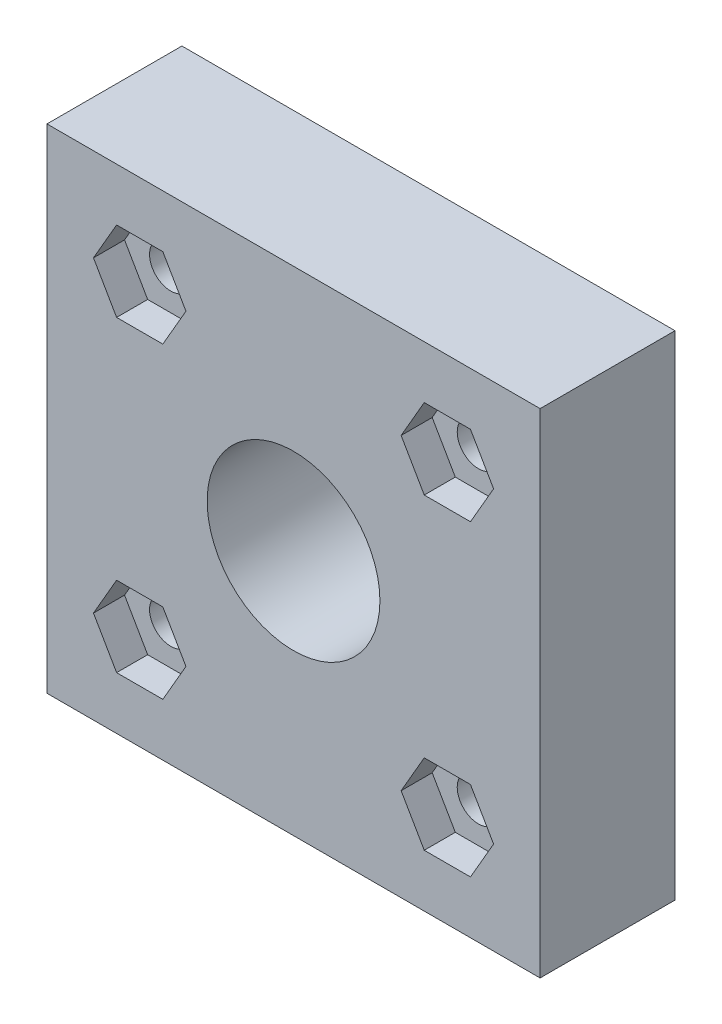
ISO-10303-21;
HEADER;
FILE_DESCRIPTION(('STEP AP214'),'2;1');
FILE_NAME('part.step','',(''),(''),'','','');
FILE_SCHEMA(('AUTOMOTIVE_DESIGN { 1 0 10303 214 1 1 1 1 }'));
ENDSEC;
DATA;
#1=APPLICATION_CONTEXT('core data for automotive mechanical design processes');
#2=APPLICATION_PROTOCOL_DEFINITION('international standard','automotive_design',2000,#1);
#3=PRODUCT_CONTEXT('',#1,'mechanical');
#4=PRODUCT('Part','Part','',(#3));
#5=PRODUCT_RELATED_PRODUCT_CATEGORY('part','',(#4));
#6=PRODUCT_DEFINITION_FORMATION('','',#4);
#7=PRODUCT_DEFINITION_CONTEXT('part definition',#1,'design');
#8=PRODUCT_DEFINITION('design','',#6,#7);
#9=PRODUCT_DEFINITION_SHAPE('','',#8);
#10=(LENGTH_UNIT() NAMED_UNIT(*) SI_UNIT(.MILLI.,.METRE.));
#11=(NAMED_UNIT(*) PLANE_ANGLE_UNIT() SI_UNIT($,.RADIAN.));
#12=(NAMED_UNIT(*) SI_UNIT($,.STERADIAN.) SOLID_ANGLE_UNIT());
#13=UNCERTAINTY_MEASURE_WITH_UNIT(LENGTH_MEASURE(1.E-05),#10,'distance_accuracy_value','');
#14=(GEOMETRIC_REPRESENTATION_CONTEXT(3) GLOBAL_UNCERTAINTY_ASSIGNED_CONTEXT((#13)) GLOBAL_UNIT_ASSIGNED_CONTEXT((#10,
#11,#12)) REPRESENTATION_CONTEXT('',''));
#15=CARTESIAN_POINT('',(0.,0.,0.));
#16=DIRECTION('',(0.,0.,1.));
#17=DIRECTION('',(1.,0.,0.));
#18=AXIS2_PLACEMENT_3D('',#15,#16,#17);
#19=CARTESIAN_POINT('',(12.7,12.7,1.6));
#20=DIRECTION('',(-1.,0.,0.));
#21=DIRECTION('',(0.,-1.,0.));
#22=AXIS2_PLACEMENT_3D('',#19,#20,#21);
#23=PLANE('',#22);
#24=DIRECTION('',(0.,0.,-1.));
#25=VECTOR('',#24,1.);
#26=CARTESIAN_POINT('',(12.7,-12.7,1.6));
#27=LINE('',#26,#25);
#28=CARTESIAN_POINT('',(12.7,-12.7,1.6));
#29=VERTEX_POINT('',#28);
#30=CARTESIAN_POINT('',(12.7,-12.7,-5.35));
#31=VERTEX_POINT('',#30);
#32=EDGE_CURVE('E216',#29,#31,#27,.T.);
#33=ORIENTED_EDGE('',*,*,#32,.T.);
#34=DIRECTION('',(0.,-1.,0.));
#35=VECTOR('',#34,1.);
#36=CARTESIAN_POINT('',(12.7,12.7,-5.35));
#37=LINE('',#36,#35);
#38=CARTESIAN_POINT('',(12.7,12.7,-5.35));
#39=VERTEX_POINT('',#38);
#40=EDGE_CURVE('E220',#39,#31,#37,.T.);
#41=ORIENTED_EDGE('',*,*,#40,.F.);
#42=DIRECTION('',(0.,0.,-1.));
#43=VECTOR('',#42,1.);
#44=CARTESIAN_POINT('',(12.7,12.7,1.6));
#45=LINE('',#44,#43);
#46=CARTESIAN_POINT('',(12.7,12.7,1.6));
#47=VERTEX_POINT('',#46);
#48=EDGE_CURVE('E11',#47,#39,#45,.T.);
#49=ORIENTED_EDGE('',*,*,#48,.F.);
#50=DIRECTION('',(0.,1.,0.));
#51=VECTOR('',#50,1.);
#52=CARTESIAN_POINT('',(12.7,12.7,1.6));
#53=LINE('',#52,#51);
#54=EDGE_CURVE('E222',#29,#47,#53,.T.);
#55=ORIENTED_EDGE('',*,*,#54,.F.);
#56=EDGE_LOOP('',(#33,#41,#49,#55));
#57=FACE_BOUND('',#56,.T.);
#58=ADVANCED_FACE('F32',(#57),#23,.F.);
#59=CARTESIAN_POINT('',(-12.7,12.7,1.6));
#60=DIRECTION('',(0.,-1.,0.));
#61=DIRECTION('',(0.,0.,-1.));
#62=AXIS2_PLACEMENT_3D('',#59,#60,#61);
#63=PLANE('',#62);
#64=ORIENTED_EDGE('',*,*,#48,.T.);
#65=DIRECTION('',(1.,0.,0.));
#66=VECTOR('',#65,1.);
#67=CARTESIAN_POINT('',(12.7,12.7,-5.35));
#68=LINE('',#67,#66);
#69=CARTESIAN_POINT('',(-12.7,12.7,-5.35));
#70=VERTEX_POINT('',#69);
#71=EDGE_CURVE('E241',#70,#39,#68,.T.);
#72=ORIENTED_EDGE('',*,*,#71,.F.);
#73=DIRECTION('',(0.,0.,-1.));
#74=VECTOR('',#73,1.);
#75=CARTESIAN_POINT('',(-12.7,12.7,1.6));
#76=LINE('',#75,#74);
#77=CARTESIAN_POINT('',(-12.7,12.7,1.6));
#78=VERTEX_POINT('',#77);
#79=EDGE_CURVE('E39',#78,#70,#76,.T.);
#80=ORIENTED_EDGE('',*,*,#79,.F.);
#81=DIRECTION('',(-1.,0.,0.));
#82=VECTOR('',#81,1.);
#83=CARTESIAN_POINT('',(-12.7,12.7,1.6));
#84=LINE('',#83,#82);
#85=EDGE_CURVE('E443',#47,#78,#84,.T.);
#86=ORIENTED_EDGE('',*,*,#85,.F.);
#87=EDGE_LOOP('',(#64,#72,#80,#86));
#88=FACE_BOUND('',#87,.T.);
#89=ADVANCED_FACE('F453',(#88),#63,.F.);
#90=CARTESIAN_POINT('',(-12.7,12.7,1.6));
#91=DIRECTION('',(1.,0.,0.));
#92=DIRECTION('',(0.,1.,0.));
#93=AXIS2_PLACEMENT_3D('',#90,#91,#92);
#94=PLANE('',#93);
#95=ORIENTED_EDGE('',*,*,#79,.T.);
#96=DIRECTION('',(0.,1.,0.));
#97=VECTOR('',#96,1.);
#98=CARTESIAN_POINT('',(-12.7,12.7,-5.35));
#99=LINE('',#98,#97);
#100=CARTESIAN_POINT('',(-12.7,-12.7,-5.35));
#101=VERTEX_POINT('',#100);
#102=EDGE_CURVE('E235',#101,#70,#99,.T.);
#103=ORIENTED_EDGE('',*,*,#102,.F.);
#104=DIRECTION('',(0.,0.,-1.));
#105=VECTOR('',#104,1.);
#106=CARTESIAN_POINT('',(-12.7,-12.7,1.6));
#107=LINE('',#106,#105);
#108=CARTESIAN_POINT('',(-12.7,-12.7,1.6));
#109=VERTEX_POINT('',#108);
#110=EDGE_CURVE('E225',#109,#101,#107,.T.);
#111=ORIENTED_EDGE('',*,*,#110,.F.);
#112=DIRECTION('',(0.,-1.,0.));
#113=VECTOR('',#112,1.);
#114=CARTESIAN_POINT('',(-12.7,12.7,1.6));
#115=LINE('',#114,#113);
#116=EDGE_CURVE('E445',#78,#109,#115,.T.);
#117=ORIENTED_EDGE('',*,*,#116,.F.);
#118=EDGE_LOOP('',(#95,#103,#111,#117));
#119=FACE_BOUND('',#118,.T.);
#120=ADVANCED_FACE('F451',(#119),#94,.F.);
#121=CARTESIAN_POINT('',(-12.7,-12.7,1.6));
#122=DIRECTION('',(0.,1.,0.));
#123=DIRECTION('',(0.,0.,1.));
#124=AXIS2_PLACEMENT_3D('',#121,#122,#123);
#125=PLANE('',#124);
#126=ORIENTED_EDGE('',*,*,#110,.T.);
#127=DIRECTION('',(-1.,0.,0.));
#128=VECTOR('',#127,1.);
#129=CARTESIAN_POINT('',(12.7,-12.7,-5.35));
#130=LINE('',#129,#128);
#131=EDGE_CURVE('E229',#31,#101,#130,.T.);
#132=ORIENTED_EDGE('',*,*,#131,.F.);
#133=ORIENTED_EDGE('',*,*,#32,.F.);
#134=DIRECTION('',(1.,0.,0.));
#135=VECTOR('',#134,1.);
#136=CARTESIAN_POINT('',(-12.7,-12.7,1.6));
#137=LINE('',#136,#135);
#138=EDGE_CURVE('E226',#109,#29,#137,.T.);
#139=ORIENTED_EDGE('',*,*,#138,.F.);
#140=EDGE_LOOP('',(#126,#132,#133,#139));
#141=FACE_BOUND('',#140,.T.);
#142=ADVANCED_FACE('F230',(#141),#125,.F.);
#143=CARTESIAN_POINT('',(0.,0.,1.6));
#144=DIRECTION('',(0.,0.,1.));
#145=DIRECTION('',(1.,0.,0.));
#146=AXIS2_PLACEMENT_3D('',#143,#144,#145);
#147=PLANE('',#146);
#148=DIRECTION('',(0.500000000000001,0.866025403784438,0.));
#149=VECTOR('',#148,1.);
#150=CARTESIAN_POINT('',(10.3045625881401,7.92331258814006,1.6));
#151=LINE('',#150,#149);
#152=CARTESIAN_POINT('',(9.11393758814007,5.86108959537837,1.6));
#153=VERTEX_POINT('',#152);
#154=CARTESIAN_POINT('',(10.3045625881401,7.92331258814006,1.6));
#155=VERTEX_POINT('',#154);
#156=EDGE_CURVE('E46',#153,#155,#151,.T.);
#157=ORIENTED_EDGE('',*,*,#156,.F.);
#158=DIRECTION('',(1.,0.,0.));
#159=VECTOR('',#158,1.);
#160=CARTESIAN_POINT('',(9.11393758814007,5.86108959537837,1.6));
#161=LINE('',#160,#159);
#162=CARTESIAN_POINT('',(6.73268758814007,5.86108959537837,1.6));
#163=VERTEX_POINT('',#162);
#164=EDGE_CURVE('E256',#163,#153,#161,.T.);
#165=ORIENTED_EDGE('',*,*,#164,.F.);
#166=DIRECTION('',(0.5,-0.866025403784439,0.));
#167=VECTOR('',#166,1.);
#168=CARTESIAN_POINT('',(6.73268758814007,5.86108959537837,1.6));
#169=LINE('',#168,#167);
#170=CARTESIAN_POINT('',(5.54206258814007,7.92331258814006,1.6));
#171=VERTEX_POINT('',#170);
#172=EDGE_CURVE('E283',#171,#163,#169,.T.);
#173=ORIENTED_EDGE('',*,*,#172,.F.);
#174=DIRECTION('',(-0.5,-0.866025403784439,0.));
#175=VECTOR('',#174,1.);
#176=CARTESIAN_POINT('',(5.54206258814007,7.92331258814006,1.6));
#177=LINE('',#176,#175);
#178=CARTESIAN_POINT('',(6.73268758814007,9.98553558090176,1.6));
#179=VERTEX_POINT('',#178);
#180=EDGE_CURVE('E280',#179,#171,#177,.T.);
#181=ORIENTED_EDGE('',*,*,#180,.F.);
#182=DIRECTION('',(-1.,0.,0.));
#183=VECTOR('',#182,1.);
#184=CARTESIAN_POINT('',(6.73268758814007,9.98553558090176,1.6));
#185=LINE('',#184,#183);
#186=CARTESIAN_POINT('',(9.11393758814007,9.98553558090176,1.6));
#187=VERTEX_POINT('',#186);
#188=EDGE_CURVE('E277',#187,#179,#185,.T.);
#189=ORIENTED_EDGE('',*,*,#188,.F.);
#190=DIRECTION('',(-0.5,0.866025403784438,0.));
#191=VECTOR('',#190,1.);
#192=CARTESIAN_POINT('',(9.11393758814007,9.98553558090176,1.6));
#193=LINE('',#192,#191);
#194=EDGE_CURVE('E273',#155,#187,#193,.T.);
#195=ORIENTED_EDGE('',*,*,#194,.F.);
#196=EDGE_LOOP('',(#157,#165,#173,#181,#189,#195));
#197=FACE_BOUND('',#196,.T.);
#198=DIRECTION('',(-1.,0.,0.));
#199=VECTOR('',#198,1.);
#200=CARTESIAN_POINT('',(9.11393758814007,-5.86108959537837,1.6));
#201=LINE('',#200,#199);
#202=CARTESIAN_POINT('',(9.11393758814007,-5.86108959537837,1.6));
#203=VERTEX_POINT('',#202);
#204=CARTESIAN_POINT('',(6.73268758814007,-5.86108959537837,1.6));
#205=VERTEX_POINT('',#204);
#206=EDGE_CURVE('E54',#203,#205,#201,.T.);
#207=ORIENTED_EDGE('',*,*,#206,.F.);
#208=DIRECTION('',(-0.500000000000001,0.866025403784438,0.));
#209=VECTOR('',#208,1.);
#210=CARTESIAN_POINT('',(10.3045625881401,-7.92331258814006,1.6));
#211=LINE('',#210,#209);
#212=CARTESIAN_POINT('',(10.3045625881401,-7.92331258814006,1.6));
#213=VERTEX_POINT('',#212);
#214=EDGE_CURVE('E304',#213,#203,#211,.T.);
#215=ORIENTED_EDGE('',*,*,#214,.F.);
#216=DIRECTION('',(0.5,0.866025403784438,0.));
#217=VECTOR('',#216,1.);
#218=CARTESIAN_POINT('',(9.11393758814007,-9.98553558090176,1.6));
#219=LINE('',#218,#217);
#220=CARTESIAN_POINT('',(9.11393758814007,-9.98553558090176,1.6));
#221=VERTEX_POINT('',#220);
#222=EDGE_CURVE('E331',#221,#213,#219,.T.);
#223=ORIENTED_EDGE('',*,*,#222,.F.);
#224=DIRECTION('',(1.,0.,0.));
#225=VECTOR('',#224,1.);
#226=CARTESIAN_POINT('',(6.73268758814007,-9.98553558090176,1.6));
#227=LINE('',#226,#225);
#228=CARTESIAN_POINT('',(6.73268758814007,-9.98553558090176,1.6));
#229=VERTEX_POINT('',#228);
#230=EDGE_CURVE('E328',#229,#221,#227,.T.);
#231=ORIENTED_EDGE('',*,*,#230,.F.);
#232=DIRECTION('',(0.5,-0.866025403784439,0.));
#233=VECTOR('',#232,1.);
#234=CARTESIAN_POINT('',(5.54206258814007,-7.92331258814006,1.6));
#235=LINE('',#234,#233);
#236=CARTESIAN_POINT('',(5.54206258814007,-7.92331258814006,1.6));
#237=VERTEX_POINT('',#236);
#238=EDGE_CURVE('E325',#237,#229,#235,.T.);
#239=ORIENTED_EDGE('',*,*,#238,.F.);
#240=DIRECTION('',(-0.5,-0.866025403784439,0.));
#241=VECTOR('',#240,1.);
#242=CARTESIAN_POINT('',(6.73268758814007,-5.86108959537837,1.6));
#243=LINE('',#242,#241);
#244=EDGE_CURVE('E321',#205,#237,#243,.T.);
#245=ORIENTED_EDGE('',*,*,#244,.F.);
#246=EDGE_LOOP('',(#207,#215,#223,#231,#239,#245));
#247=FACE_BOUND('',#246,.T.);
#248=DIRECTION('',(-0.5,-0.866025403784439,0.));
#249=VECTOR('',#248,1.);
#250=CARTESIAN_POINT('',(-10.3045625881401,-7.92331258814007,1.6));
#251=LINE('',#250,#249);
#252=CARTESIAN_POINT('',(-9.11393758814007,-5.86108959537837,1.6));
#253=VERTEX_POINT('',#252);
#254=CARTESIAN_POINT('',(-10.3045625881401,-7.92331258814007,1.6));
#255=VERTEX_POINT('',#254);
#256=EDGE_CURVE('E251',#253,#255,#251,.T.);
#257=ORIENTED_EDGE('',*,*,#256,.F.);
#258=DIRECTION('',(-1.,0.,0.));
#259=VECTOR('',#258,1.);
#260=CARTESIAN_POINT('',(-9.11393758814007,-5.86108959537837,1.6));
#261=LINE('',#260,#259);
#262=CARTESIAN_POINT('',(-6.73268758814007,-5.86108959537838,1.6));
#263=VERTEX_POINT('',#262);
#264=EDGE_CURVE('E350',#263,#253,#261,.T.);
#265=ORIENTED_EDGE('',*,*,#264,.F.);
#266=DIRECTION('',(-0.5,0.866025403784439,0.));
#267=VECTOR('',#266,1.);
#268=CARTESIAN_POINT('',(-6.73268758814007,-5.86108959537838,1.6));
#269=LINE('',#268,#267);
#270=CARTESIAN_POINT('',(-5.54206258814007,-7.92331258814007,1.6));
#271=VERTEX_POINT('',#270);
#272=EDGE_CURVE('E376',#271,#263,#269,.T.);
#273=ORIENTED_EDGE('',*,*,#272,.F.);
#274=DIRECTION('',(0.5,0.866025403784439,0.));
#275=VECTOR('',#274,1.);
#276=CARTESIAN_POINT('',(-5.54206258814007,-7.92331258814007,1.6));
#277=LINE('',#276,#275);
#278=CARTESIAN_POINT('',(-6.73268758814007,-9.98553558090176,1.6));
#279=VERTEX_POINT('',#278);
#280=EDGE_CURVE('E373',#279,#271,#277,.T.);
#281=ORIENTED_EDGE('',*,*,#280,.F.);
#282=DIRECTION('',(1.,0.,0.));
#283=VECTOR('',#282,1.);
#284=CARTESIAN_POINT('',(-6.73268758814007,-9.98553558090176,1.6));
#285=LINE('',#284,#283);
#286=CARTESIAN_POINT('',(-9.11393758814007,-9.98553558090176,1.6));
#287=VERTEX_POINT('',#286);
#288=EDGE_CURVE('E370',#287,#279,#285,.T.);
#289=ORIENTED_EDGE('',*,*,#288,.F.);
#290=DIRECTION('',(0.5,-0.866025403784438,0.));
#291=VECTOR('',#290,1.);
#292=CARTESIAN_POINT('',(-9.11393758814007,-9.98553558090176,1.6));
#293=LINE('',#292,#291);
#294=EDGE_CURVE('E367',#255,#287,#293,.T.);
#295=ORIENTED_EDGE('',*,*,#294,.F.);
#296=EDGE_LOOP('',(#257,#265,#273,#281,#289,#295));
#297=FACE_BOUND('',#296,.T.);
#298=DIRECTION('',(1.,0.,0.));
#299=VECTOR('',#298,1.);
#300=CARTESIAN_POINT('',(-9.11393758814007,5.86108959537837,1.6));
#301=LINE('',#300,#299);
#302=CARTESIAN_POINT('',(-9.11393758814007,5.86108959537837,1.6));
#303=VERTEX_POINT('',#302);
#304=CARTESIAN_POINT('',(-6.73268758814007,5.86108959537838,1.6));
#305=VERTEX_POINT('',#304);
#306=EDGE_CURVE('E290',#303,#305,#301,.T.);
#307=ORIENTED_EDGE('',*,*,#306,.F.);
#308=DIRECTION('',(0.5,-0.866025403784439,0.));
#309=VECTOR('',#308,1.);
#310=CARTESIAN_POINT('',(-10.3045625881401,7.92331258814007,1.6));
#311=LINE('',#310,#309);
#312=CARTESIAN_POINT('',(-10.3045625881401,7.92331258814007,1.6));
#313=VERTEX_POINT('',#312);
#314=EDGE_CURVE('E396',#313,#303,#311,.T.);
#315=ORIENTED_EDGE('',*,*,#314,.F.);
#316=DIRECTION('',(-0.5,-0.866025403784438,0.));
#317=VECTOR('',#316,1.);
#318=CARTESIAN_POINT('',(-9.11393758814007,9.98553558090176,1.6));
#319=LINE('',#318,#317);
#320=CARTESIAN_POINT('',(-9.11393758814007,9.98553558090176,1.6));
#321=VERTEX_POINT('',#320);
#322=EDGE_CURVE('E422',#321,#313,#319,.T.);
#323=ORIENTED_EDGE('',*,*,#322,.F.);
#324=DIRECTION('',(-1.,0.,0.));
#325=VECTOR('',#324,1.);
#326=CARTESIAN_POINT('',(-6.73268758814007,9.98553558090176,1.6));
#327=LINE('',#326,#325);
#328=CARTESIAN_POINT('',(-6.73268758814007,9.98553558090176,1.6));
#329=VERTEX_POINT('',#328);
#330=EDGE_CURVE('E419',#329,#321,#327,.T.);
#331=ORIENTED_EDGE('',*,*,#330,.F.);
#332=DIRECTION('',(-0.5,0.866025403784439,0.));
#333=VECTOR('',#332,1.);
#334=CARTESIAN_POINT('',(-5.54206258814007,7.92331258814007,1.6));
#335=LINE('',#334,#333);
#336=CARTESIAN_POINT('',(-5.54206258814007,7.92331258814007,1.6));
#337=VERTEX_POINT('',#336);
#338=EDGE_CURVE('E416',#337,#329,#335,.T.);
#339=ORIENTED_EDGE('',*,*,#338,.F.);
#340=DIRECTION('',(0.5,0.866025403784439,0.));
#341=VECTOR('',#340,1.);
#342=CARTESIAN_POINT('',(-6.73268758814007,5.86108959537838,1.6));
#343=LINE('',#342,#341);
#344=EDGE_CURVE('E413',#305,#337,#343,.T.);
#345=ORIENTED_EDGE('',*,*,#344,.F.);
#346=EDGE_LOOP('',(#307,#315,#323,#331,#339,#345));
#347=FACE_BOUND('',#346,.T.);
#348=CARTESIAN_POINT('',(0.,0.,1.6));
#349=DIRECTION('',(0.,0.,1.));
#350=DIRECTION('',(1.,0.,0.));
#351=AXIS2_PLACEMENT_3D('',#348,#349,#350);
#352=CIRCLE('',#351,4.45);
#353=CARTESIAN_POINT('',(4.45,0.,1.6));
#354=VERTEX_POINT('',#353);
#355=EDGE_CURVE('E429',#354,#354,#352,.T.);
#356=ORIENTED_EDGE('',*,*,#355,.F.);
#357=EDGE_LOOP('',(#356));
#358=FACE_BOUND('',#357,.T.);
#359=ORIENTED_EDGE('',*,*,#54,.T.);
#360=ORIENTED_EDGE('',*,*,#85,.T.);
#361=ORIENTED_EDGE('',*,*,#116,.T.);
#362=ORIENTED_EDGE('',*,*,#138,.T.);
#363=EDGE_LOOP('',(#359,#360,#361,#362));
#364=FACE_BOUND('',#363,.T.);
#365=ADVANCED_FACE('F455',(#197,#247,#297,#347,#358,#364),#147,.T.);
#366=CARTESIAN_POINT('',(0.,0.,0.));
#367=DIRECTION('',(0.,0.,1.));
#368=DIRECTION('',(1.,0.,0.));
#369=AXIS2_PLACEMENT_3D('',#366,#367,#368);
#370=CYLINDRICAL_SURFACE('',#369,4.45);
#371=ORIENTED_EDGE('',*,*,#355,.T.);
#372=EDGE_LOOP('',(#371));
#373=FACE_BOUND('',#372,.T.);
#374=CARTESIAN_POINT('',(0.,0.,-5.35));
#375=DIRECTION('',(0.,0.,-1.));
#376=DIRECTION('',(-1.,0.,0.));
#377=AXIS2_PLACEMENT_3D('',#374,#375,#376);
#378=CIRCLE('',#377,4.45);
#379=CARTESIAN_POINT('',(-4.45,0.,-5.35));
#380=VERTEX_POINT('',#379);
#381=EDGE_CURVE('E826',#380,#380,#378,.T.);
#382=ORIENTED_EDGE('',*,*,#381,.T.);
#383=EDGE_LOOP('',(#382));
#384=FACE_BOUND('',#383,.T.);
#385=ADVANCED_FACE('F457',(#373,#384),#370,.F.);
#386=CARTESIAN_POINT('',(-9.11393758814007,5.86108959537837,0.));
#387=DIRECTION('',(0.,-1.,0.));
#388=DIRECTION('',(1.,0.,0.));
#389=AXIS2_PLACEMENT_3D('',#386,#387,#388);
#390=PLANE('',#389);
#391=ORIENTED_EDGE('',*,*,#306,.T.);
#392=DIRECTION('',(0.,0.,1.));
#393=VECTOR('',#392,1.);
#394=CARTESIAN_POINT('',(-6.73268758814007,5.86108959537838,0.));
#395=LINE('',#394,#393);
#396=CARTESIAN_POINT('',(-6.73268758814007,5.86108959537838,0.));
#397=VERTEX_POINT('',#396);
#398=EDGE_CURVE('E411',#397,#305,#395,.T.);
#399=ORIENTED_EDGE('',*,*,#398,.F.);
#400=DIRECTION('',(1.,0.,0.));
#401=VECTOR('',#400,1.);
#402=CARTESIAN_POINT('',(-9.11393758814007,5.86108959537837,0.));
#403=LINE('',#402,#401);
#404=CARTESIAN_POINT('',(-9.11393758814007,5.86108959537837,0.));
#405=VERTEX_POINT('',#404);
#406=EDGE_CURVE('E392',#405,#397,#403,.T.);
#407=ORIENTED_EDGE('',*,*,#406,.F.);
#408=DIRECTION('',(0.,0.,1.));
#409=VECTOR('',#408,1.);
#410=CARTESIAN_POINT('',(-9.11393758814007,5.86108959537837,0.));
#411=LINE('',#410,#409);
#412=EDGE_CURVE('E427',#405,#303,#411,.T.);
#413=ORIENTED_EDGE('',*,*,#412,.T.);
#414=EDGE_LOOP('',(#391,#399,#407,#413));
#415=FACE_BOUND('',#414,.T.);
#416=ADVANCED_FACE('F464',(#415),#390,.F.);
#417=CARTESIAN_POINT('',(-10.3045625881401,7.92331258814007,0.));
#418=DIRECTION('',(-0.866025403784439,-0.5,0.));
#419=DIRECTION('',(0.5,-0.866025403784439,0.));
#420=AXIS2_PLACEMENT_3D('',#417,#418,#419);
#421=PLANE('',#420);
#422=ORIENTED_EDGE('',*,*,#314,.T.);
#423=ORIENTED_EDGE('',*,*,#412,.F.);
#424=DIRECTION('',(0.5,-0.866025403784439,0.));
#425=VECTOR('',#424,1.);
#426=CARTESIAN_POINT('',(-10.3045625881401,7.92331258814007,0.));
#427=LINE('',#426,#425);
#428=CARTESIAN_POINT('',(-10.3045625881401,7.92331258814007,0.));
#429=VERTEX_POINT('',#428);
#430=EDGE_CURVE('E408',#429,#405,#427,.T.);
#431=ORIENTED_EDGE('',*,*,#430,.F.);
#432=DIRECTION('',(0.,0.,1.));
#433=VECTOR('',#432,1.);
#434=CARTESIAN_POINT('',(-10.3045625881401,7.92331258814007,0.));
#435=LINE('',#434,#433);
#436=EDGE_CURVE('E430',#429,#313,#435,.T.);
#437=ORIENTED_EDGE('',*,*,#436,.T.);
#438=EDGE_LOOP('',(#422,#423,#431,#437));
#439=FACE_BOUND('',#438,.T.);
#440=ADVANCED_FACE('F501',(#439),#421,.F.);
#441=CARTESIAN_POINT('',(-9.11393758814007,9.98553558090176,0.));
#442=DIRECTION('',(-0.866025403784438,0.5,0.));
#443=DIRECTION('',(-0.5,-0.866025403784439,0.));
#444=AXIS2_PLACEMENT_3D('',#441,#442,#443);
#445=PLANE('',#444);
#446=ORIENTED_EDGE('',*,*,#322,.T.);
#447=ORIENTED_EDGE('',*,*,#436,.F.);
#448=DIRECTION('',(-0.5,-0.866025403784438,0.));
#449=VECTOR('',#448,1.);
#450=CARTESIAN_POINT('',(-9.11393758814007,9.98553558090176,0.));
#451=LINE('',#450,#449);
#452=CARTESIAN_POINT('',(-9.11393758814007,9.98553558090176,0.));
#453=VERTEX_POINT('',#452);
#454=EDGE_CURVE('E405',#453,#429,#451,.T.);
#455=ORIENTED_EDGE('',*,*,#454,.F.);
#456=DIRECTION('',(0.,0.,1.));
#457=VECTOR('',#456,1.);
#458=CARTESIAN_POINT('',(-9.11393758814007,9.98553558090176,0.));
#459=LINE('',#458,#457);
#460=EDGE_CURVE('E432',#453,#321,#459,.T.);
#461=ORIENTED_EDGE('',*,*,#460,.T.);
#462=EDGE_LOOP('',(#446,#447,#455,#461));
#463=FACE_BOUND('',#462,.T.);
#464=ADVANCED_FACE('F511',(#463),#445,.F.);
#465=CARTESIAN_POINT('',(-6.73268758814007,9.98553558090176,0.));
#466=DIRECTION('',(0.,1.,0.));
#467=DIRECTION('',(0.,0.,1.));
#468=AXIS2_PLACEMENT_3D('',#465,#466,#467);
#469=PLANE('',#468);
#470=ORIENTED_EDGE('',*,*,#330,.T.);
#471=ORIENTED_EDGE('',*,*,#460,.F.);
#472=DIRECTION('',(-1.,0.,0.));
#473=VECTOR('',#472,1.);
#474=CARTESIAN_POINT('',(-6.73268758814007,9.98553558090176,0.));
#475=LINE('',#474,#473);
#476=CARTESIAN_POINT('',(-6.73268758814007,9.98553558090176,0.));
#477=VERTEX_POINT('',#476);
#478=EDGE_CURVE('E402',#477,#453,#475,.T.);
#479=ORIENTED_EDGE('',*,*,#478,.F.);
#480=DIRECTION('',(0.,0.,1.));
#481=VECTOR('',#480,1.);
#482=CARTESIAN_POINT('',(-6.73268758814007,9.98553558090176,0.));
#483=LINE('',#482,#481);
#484=EDGE_CURVE('E434',#477,#329,#483,.T.);
#485=ORIENTED_EDGE('',*,*,#484,.T.);
#486=EDGE_LOOP('',(#470,#471,#479,#485));
#487=FACE_BOUND('',#486,.T.);
#488=ADVANCED_FACE('F521',(#487),#469,.F.);
#489=CARTESIAN_POINT('',(-5.54206258814007,7.92331258814007,0.));
#490=DIRECTION('',(0.866025403784439,0.5,0.));
#491=DIRECTION('',(-0.5,0.866025403784439,0.));
#492=AXIS2_PLACEMENT_3D('',#489,#490,#491);
#493=PLANE('',#492);
#494=ORIENTED_EDGE('',*,*,#338,.T.);
#495=ORIENTED_EDGE('',*,*,#484,.F.);
#496=DIRECTION('',(-0.5,0.866025403784439,0.));
#497=VECTOR('',#496,1.);
#498=CARTESIAN_POINT('',(-5.54206258814007,7.92331258814007,0.));
#499=LINE('',#498,#497);
#500=CARTESIAN_POINT('',(-5.54206258814007,7.92331258814007,0.));
#501=VERTEX_POINT('',#500);
#502=EDGE_CURVE('E399',#501,#477,#499,.T.);
#503=ORIENTED_EDGE('',*,*,#502,.F.);
#504=DIRECTION('',(0.,0.,1.));
#505=VECTOR('',#504,1.);
#506=CARTESIAN_POINT('',(-5.54206258814007,7.92331258814007,0.));
#507=LINE('',#506,#505);
#508=EDGE_CURVE('E436',#501,#337,#507,.T.);
#509=ORIENTED_EDGE('',*,*,#508,.T.);
#510=EDGE_LOOP('',(#494,#495,#503,#509));
#511=FACE_BOUND('',#510,.T.);
#512=ADVANCED_FACE('F531',(#511),#493,.F.);
#513=CARTESIAN_POINT('',(-6.73268758814007,5.86108959537838,0.));
#514=DIRECTION('',(0.866025403784439,-0.5,0.));
#515=DIRECTION('',(0.5,0.866025403784439,0.));
#516=AXIS2_PLACEMENT_3D('',#513,#514,#515);
#517=PLANE('',#516);
#518=ORIENTED_EDGE('',*,*,#344,.T.);
#519=ORIENTED_EDGE('',*,*,#508,.F.);
#520=DIRECTION('',(0.5,0.866025403784439,0.));
#521=VECTOR('',#520,1.);
#522=CARTESIAN_POINT('',(-6.73268758814007,5.86108959537838,0.));
#523=LINE('',#522,#521);
#524=EDGE_CURVE('E395',#397,#501,#523,.T.);
#525=ORIENTED_EDGE('',*,*,#524,.F.);
#526=ORIENTED_EDGE('',*,*,#398,.T.);
#527=EDGE_LOOP('',(#518,#519,#525,#526));
#528=FACE_BOUND('',#527,.T.);
#529=ADVANCED_FACE('F541',(#528),#517,.F.);
#530=CARTESIAN_POINT('',(-10.3045625881401,-7.92331258814007,0.));
#531=DIRECTION('',(-0.866025403784439,0.5,0.));
#532=DIRECTION('',(-0.5,-0.866025403784439,0.));
#533=AXIS2_PLACEMENT_3D('',#530,#531,#532);
#534=PLANE('',#533);
#535=ORIENTED_EDGE('',*,*,#256,.T.);
#536=DIRECTION('',(0.,0.,1.));
#537=VECTOR('',#536,1.);
#538=CARTESIAN_POINT('',(-10.3045625881401,-7.92331258814007,0.));
#539=LINE('',#538,#537);
#540=CARTESIAN_POINT('',(-10.3045625881401,-7.92331258814007,0.));
#541=VERTEX_POINT('',#540);
#542=EDGE_CURVE('E365',#541,#255,#539,.T.);
#543=ORIENTED_EDGE('',*,*,#542,.F.);
#544=DIRECTION('',(-0.5,-0.866025403784439,0.));
#545=VECTOR('',#544,1.);
#546=CARTESIAN_POINT('',(-10.3045625881401,-7.92331258814007,0.));
#547=LINE('',#546,#545);
#548=CARTESIAN_POINT('',(-9.11393758814007,-5.86108959537837,0.));
#549=VERTEX_POINT('',#548);
#550=EDGE_CURVE('E346',#549,#541,#547,.T.);
#551=ORIENTED_EDGE('',*,*,#550,.F.);
#552=DIRECTION('',(0.,0.,1.));
#553=VECTOR('',#552,1.);
#554=CARTESIAN_POINT('',(-9.11393758814007,-5.86108959537837,0.));
#555=LINE('',#554,#553);
#556=EDGE_CURVE('E322',#549,#253,#555,.T.);
#557=ORIENTED_EDGE('',*,*,#556,.T.);
#558=EDGE_LOOP('',(#535,#543,#551,#557));
#559=FACE_BOUND('',#558,.T.);
#560=ADVANCED_FACE('F551',(#559),#534,.F.);
#561=CARTESIAN_POINT('',(-9.11393758814007,-5.86108959537837,0.));
#562=DIRECTION('',(0.,1.,0.));
#563=DIRECTION('',(-1.,0.,0.));
#564=AXIS2_PLACEMENT_3D('',#561,#562,#563);
#565=PLANE('',#564);
#566=ORIENTED_EDGE('',*,*,#264,.T.);
#567=ORIENTED_EDGE('',*,*,#556,.F.);
#568=DIRECTION('',(-1.,0.,0.));
#569=VECTOR('',#568,1.);
#570=CARTESIAN_POINT('',(-9.11393758814007,-5.86108959537837,0.));
#571=LINE('',#570,#569);
#572=CARTESIAN_POINT('',(-6.73268758814007,-5.86108959537838,0.));
#573=VERTEX_POINT('',#572);
#574=EDGE_CURVE('E362',#573,#549,#571,.T.);
#575=ORIENTED_EDGE('',*,*,#574,.F.);
#576=DIRECTION('',(0.,0.,1.));
#577=VECTOR('',#576,1.);
#578=CARTESIAN_POINT('',(-6.73268758814007,-5.86108959537838,0.));
#579=LINE('',#578,#577);
#580=EDGE_CURVE('E382',#573,#263,#579,.T.);
#581=ORIENTED_EDGE('',*,*,#580,.T.);
#582=EDGE_LOOP('',(#566,#567,#575,#581));
#583=FACE_BOUND('',#582,.T.);
#584=ADVANCED_FACE('F561',(#583),#565,.F.);
#585=CARTESIAN_POINT('',(-6.73268758814007,-5.86108959537838,0.));
#586=DIRECTION('',(0.866025403784439,0.5,0.));
#587=DIRECTION('',(-0.5,0.866025403784439,0.));
#588=AXIS2_PLACEMENT_3D('',#585,#586,#587);
#589=PLANE('',#588);
#590=ORIENTED_EDGE('',*,*,#272,.T.);
#591=ORIENTED_EDGE('',*,*,#580,.F.);
#592=DIRECTION('',(-0.5,0.866025403784439,0.));
#593=VECTOR('',#592,1.);
#594=CARTESIAN_POINT('',(-6.73268758814007,-5.86108959537838,0.));
#595=LINE('',#594,#593);
#596=CARTESIAN_POINT('',(-5.54206258814007,-7.92331258814007,0.));
#597=VERTEX_POINT('',#596);
#598=EDGE_CURVE('E359',#597,#573,#595,.T.);
#599=ORIENTED_EDGE('',*,*,#598,.F.);
#600=DIRECTION('',(0.,0.,1.));
#601=VECTOR('',#600,1.);
#602=CARTESIAN_POINT('',(-5.54206258814007,-7.92331258814007,0.));
#603=LINE('',#602,#601);
#604=EDGE_CURVE('E384',#597,#271,#603,.T.);
#605=ORIENTED_EDGE('',*,*,#604,.T.);
#606=EDGE_LOOP('',(#590,#591,#599,#605));
#607=FACE_BOUND('',#606,.T.);
#608=ADVANCED_FACE('F571',(#607),#589,.F.);
#609=CARTESIAN_POINT('',(-5.54206258814007,-7.92331258814007,0.));
#610=DIRECTION('',(0.866025403784439,-0.5,0.));
#611=DIRECTION('',(0.5,0.866025403784439,0.));
#612=AXIS2_PLACEMENT_3D('',#609,#610,#611);
#613=PLANE('',#612);
#614=ORIENTED_EDGE('',*,*,#280,.T.);
#615=ORIENTED_EDGE('',*,*,#604,.F.);
#616=DIRECTION('',(0.5,0.866025403784439,0.));
#617=VECTOR('',#616,1.);
#618=CARTESIAN_POINT('',(-5.54206258814007,-7.92331258814007,0.));
#619=LINE('',#618,#617);
#620=CARTESIAN_POINT('',(-6.73268758814007,-9.98553558090176,0.));
#621=VERTEX_POINT('',#620);
#622=EDGE_CURVE('E356',#621,#597,#619,.T.);
#623=ORIENTED_EDGE('',*,*,#622,.F.);
#624=DIRECTION('',(0.,0.,1.));
#625=VECTOR('',#624,1.);
#626=CARTESIAN_POINT('',(-6.73268758814007,-9.98553558090176,0.));
#627=LINE('',#626,#625);
#628=EDGE_CURVE('E386',#621,#279,#627,.T.);
#629=ORIENTED_EDGE('',*,*,#628,.T.);
#630=EDGE_LOOP('',(#614,#615,#623,#629));
#631=FACE_BOUND('',#630,.T.);
#632=ADVANCED_FACE('F581',(#631),#613,.F.);
#633=CARTESIAN_POINT('',(-6.73268758814007,-9.98553558090176,0.));
#634=DIRECTION('',(0.,-1.,0.));
#635=DIRECTION('',(0.,0.,-1.));
#636=AXIS2_PLACEMENT_3D('',#633,#634,#635);
#637=PLANE('',#636);
#638=ORIENTED_EDGE('',*,*,#288,.T.);
#639=ORIENTED_EDGE('',*,*,#628,.F.);
#640=DIRECTION('',(1.,0.,0.));
#641=VECTOR('',#640,1.);
#642=CARTESIAN_POINT('',(-6.73268758814007,-9.98553558090176,0.));
#643=LINE('',#642,#641);
#644=CARTESIAN_POINT('',(-9.11393758814007,-9.98553558090176,0.));
#645=VERTEX_POINT('',#644);
#646=EDGE_CURVE('E353',#645,#621,#643,.T.);
#647=ORIENTED_EDGE('',*,*,#646,.F.);
#648=DIRECTION('',(0.,0.,1.));
#649=VECTOR('',#648,1.);
#650=CARTESIAN_POINT('',(-9.11393758814007,-9.98553558090176,0.));
#651=LINE('',#650,#649);
#652=EDGE_CURVE('E388',#645,#287,#651,.T.);
#653=ORIENTED_EDGE('',*,*,#652,.T.);
#654=EDGE_LOOP('',(#638,#639,#647,#653));
#655=FACE_BOUND('',#654,.T.);
#656=ADVANCED_FACE('F591',(#655),#637,.F.);
#657=CARTESIAN_POINT('',(-9.11393758814007,-9.98553558090176,0.));
#658=DIRECTION('',(-0.866025403784438,-0.5,0.));
#659=DIRECTION('',(0.5,-0.866025403784439,0.));
#660=AXIS2_PLACEMENT_3D('',#657,#658,#659);
#661=PLANE('',#660);
#662=ORIENTED_EDGE('',*,*,#294,.T.);
#663=ORIENTED_EDGE('',*,*,#652,.F.);
#664=DIRECTION('',(0.5,-0.866025403784438,0.));
#665=VECTOR('',#664,1.);
#666=CARTESIAN_POINT('',(-9.11393758814007,-9.98553558090176,0.));
#667=LINE('',#666,#665);
#668=EDGE_CURVE('E349',#541,#645,#667,.T.);
#669=ORIENTED_EDGE('',*,*,#668,.F.);
#670=ORIENTED_EDGE('',*,*,#542,.T.);
#671=EDGE_LOOP('',(#662,#663,#669,#670));
#672=FACE_BOUND('',#671,.T.);
#673=ADVANCED_FACE('F601',(#672),#661,.F.);
#674=CARTESIAN_POINT('',(9.11393758814007,-5.86108959537837,0.));
#675=DIRECTION('',(0.,1.,0.));
#676=DIRECTION('',(-1.,0.,0.));
#677=AXIS2_PLACEMENT_3D('',#674,#675,#676);
#678=PLANE('',#677);
#679=ORIENTED_EDGE('',*,*,#206,.T.);
#680=DIRECTION('',(0.,0.,1.));
#681=VECTOR('',#680,1.);
#682=CARTESIAN_POINT('',(6.73268758814007,-5.86108959537837,0.));
#683=LINE('',#682,#681);
#684=CARTESIAN_POINT('',(6.73268758814007,-5.86108959537837,0.));
#685=VERTEX_POINT('',#684);
#686=EDGE_CURVE('E319',#685,#205,#683,.T.);
#687=ORIENTED_EDGE('',*,*,#686,.F.);
#688=DIRECTION('',(-1.,0.,0.));
#689=VECTOR('',#688,1.);
#690=CARTESIAN_POINT('',(9.11393758814007,-5.86108959537837,0.));
#691=LINE('',#690,#689);
#692=CARTESIAN_POINT('',(9.11393758814007,-5.86108959537837,0.));
#693=VERTEX_POINT('',#692);
#694=EDGE_CURVE('E300',#693,#685,#691,.T.);
#695=ORIENTED_EDGE('',*,*,#694,.F.);
#696=DIRECTION('',(0.,0.,1.));
#697=VECTOR('',#696,1.);
#698=CARTESIAN_POINT('',(9.11393758814007,-5.86108959537837,0.));
#699=LINE('',#698,#697);
#700=EDGE_CURVE('E274',#693,#203,#699,.T.);
#701=ORIENTED_EDGE('',*,*,#700,.T.);
#702=EDGE_LOOP('',(#679,#687,#695,#701));
#703=FACE_BOUND('',#702,.T.);
#704=ADVANCED_FACE('F611',(#703),#678,.F.);
#705=CARTESIAN_POINT('',(10.3045625881401,-7.92331258814006,0.));
#706=DIRECTION('',(0.866025403784438,0.500000000000001,0.));
#707=DIRECTION('',(-0.500000000000001,0.866025403784438,0.));
#708=AXIS2_PLACEMENT_3D('',#705,#706,#707);
#709=PLANE('',#708);
#710=ORIENTED_EDGE('',*,*,#214,.T.);
#711=ORIENTED_EDGE('',*,*,#700,.F.);
#712=DIRECTION('',(-0.500000000000001,0.866025403784438,0.));
#713=VECTOR('',#712,1.);
#714=CARTESIAN_POINT('',(10.3045625881401,-7.92331258814006,0.));
#715=LINE('',#714,#713);
#716=CARTESIAN_POINT('',(10.3045625881401,-7.92331258814006,0.));
#717=VERTEX_POINT('',#716);
#718=EDGE_CURVE('E316',#717,#693,#715,.T.);
#719=ORIENTED_EDGE('',*,*,#718,.F.);
#720=DIRECTION('',(0.,0.,1.));
#721=VECTOR('',#720,1.);
#722=CARTESIAN_POINT('',(10.3045625881401,-7.92331258814006,0.));
#723=LINE('',#722,#721);
#724=EDGE_CURVE('E337',#717,#213,#723,.T.);
#725=ORIENTED_EDGE('',*,*,#724,.T.);
#726=EDGE_LOOP('',(#710,#711,#719,#725));
#727=FACE_BOUND('',#726,.T.);
#728=ADVANCED_FACE('F621',(#727),#709,.F.);
#729=CARTESIAN_POINT('',(9.11393758814007,-9.98553558090176,0.));
#730=DIRECTION('',(0.866025403784438,-0.5,0.));
#731=DIRECTION('',(0.5,0.866025403784439,0.));
#732=AXIS2_PLACEMENT_3D('',#729,#730,#731);
#733=PLANE('',#732);
#734=ORIENTED_EDGE('',*,*,#222,.T.);
#735=ORIENTED_EDGE('',*,*,#724,.F.);
#736=DIRECTION('',(0.5,0.866025403784438,0.));
#737=VECTOR('',#736,1.);
#738=CARTESIAN_POINT('',(9.11393758814007,-9.98553558090176,0.));
#739=LINE('',#738,#737);
#740=CARTESIAN_POINT('',(9.11393758814007,-9.98553558090176,0.));
#741=VERTEX_POINT('',#740);
#742=EDGE_CURVE('E313',#741,#717,#739,.T.);
#743=ORIENTED_EDGE('',*,*,#742,.F.);
#744=DIRECTION('',(0.,0.,1.));
#745=VECTOR('',#744,1.);
#746=CARTESIAN_POINT('',(9.11393758814007,-9.98553558090176,0.));
#747=LINE('',#746,#745);
#748=EDGE_CURVE('E339',#741,#221,#747,.T.);
#749=ORIENTED_EDGE('',*,*,#748,.T.);
#750=EDGE_LOOP('',(#734,#735,#743,#749));
#751=FACE_BOUND('',#750,.T.);
#752=ADVANCED_FACE('F630',(#751),#733,.F.);
#753=CARTESIAN_POINT('',(6.73268758814007,-9.98553558090176,0.));
#754=DIRECTION('',(0.,-1.,0.));
#755=DIRECTION('',(0.,0.,-1.));
#756=AXIS2_PLACEMENT_3D('',#753,#754,#755);
#757=PLANE('',#756);
#758=ORIENTED_EDGE('',*,*,#230,.T.);
#759=ORIENTED_EDGE('',*,*,#748,.F.);
#760=DIRECTION('',(1.,0.,0.));
#761=VECTOR('',#760,1.);
#762=CARTESIAN_POINT('',(6.73268758814007,-9.98553558090176,0.));
#763=LINE('',#762,#761);
#764=CARTESIAN_POINT('',(6.73268758814007,-9.98553558090176,0.));
#765=VERTEX_POINT('',#764);
#766=EDGE_CURVE('E310',#765,#741,#763,.T.);
#767=ORIENTED_EDGE('',*,*,#766,.F.);
#768=DIRECTION('',(0.,0.,1.));
#769=VECTOR('',#768,1.);
#770=CARTESIAN_POINT('',(6.73268758814007,-9.98553558090176,0.));
#771=LINE('',#770,#769);
#772=EDGE_CURVE('E341',#765,#229,#771,.T.);
#773=ORIENTED_EDGE('',*,*,#772,.T.);
#774=EDGE_LOOP('',(#758,#759,#767,#773));
#775=FACE_BOUND('',#774,.T.);
#776=ADVANCED_FACE('F640',(#775),#757,.F.);
#777=CARTESIAN_POINT('',(5.54206258814007,-7.92331258814006,0.));
#778=DIRECTION('',(-0.866025403784439,-0.5,0.));
#779=DIRECTION('',(0.5,-0.866025403784439,0.));
#780=AXIS2_PLACEMENT_3D('',#777,#778,#779);
#781=PLANE('',#780);
#782=ORIENTED_EDGE('',*,*,#238,.T.);
#783=ORIENTED_EDGE('',*,*,#772,.F.);
#784=DIRECTION('',(0.5,-0.866025403784439,0.));
#785=VECTOR('',#784,1.);
#786=CARTESIAN_POINT('',(5.54206258814007,-7.92331258814006,0.));
#787=LINE('',#786,#785);
#788=CARTESIAN_POINT('',(5.54206258814007,-7.92331258814006,0.));
#789=VERTEX_POINT('',#788);
#790=EDGE_CURVE('E307',#789,#765,#787,.T.);
#791=ORIENTED_EDGE('',*,*,#790,.F.);
#792=DIRECTION('',(0.,0.,1.));
#793=VECTOR('',#792,1.);
#794=CARTESIAN_POINT('',(5.54206258814007,-7.92331258814006,0.));
#795=LINE('',#794,#793);
#796=EDGE_CURVE('E343',#789,#237,#795,.T.);
#797=ORIENTED_EDGE('',*,*,#796,.T.);
#798=EDGE_LOOP('',(#782,#783,#791,#797));
#799=FACE_BOUND('',#798,.T.);
#800=ADVANCED_FACE('F650',(#799),#781,.F.);
#801=CARTESIAN_POINT('',(6.73268758814007,-5.86108959537837,0.));
#802=DIRECTION('',(-0.866025403784439,0.5,0.));
#803=DIRECTION('',(-0.5,-0.866025403784439,0.));
#804=AXIS2_PLACEMENT_3D('',#801,#802,#803);
#805=PLANE('',#804);
#806=ORIENTED_EDGE('',*,*,#244,.T.);
#807=ORIENTED_EDGE('',*,*,#796,.F.);
#808=DIRECTION('',(-0.5,-0.866025403784439,0.));
#809=VECTOR('',#808,1.);
#810=CARTESIAN_POINT('',(6.73268758814007,-5.86108959537837,0.));
#811=LINE('',#810,#809);
#812=EDGE_CURVE('E303',#685,#789,#811,.T.);
#813=ORIENTED_EDGE('',*,*,#812,.F.);
#814=ORIENTED_EDGE('',*,*,#686,.T.);
#815=EDGE_LOOP('',(#806,#807,#813,#814));
#816=FACE_BOUND('',#815,.T.);
#817=ADVANCED_FACE('F660',(#816),#805,.F.);
#818=CARTESIAN_POINT('',(10.3045625881401,7.92331258814006,0.));
#819=DIRECTION('',(0.866025403784438,-0.500000000000001,0.));
#820=DIRECTION('',(0.500000000000001,0.866025403784438,0.));
#821=AXIS2_PLACEMENT_3D('',#818,#819,#820);
#822=PLANE('',#821);
#823=ORIENTED_EDGE('',*,*,#156,.T.);
#824=DIRECTION('',(0.,0.,1.));
#825=VECTOR('',#824,1.);
#826=CARTESIAN_POINT('',(10.3045625881401,7.92331258814006,0.));
#827=LINE('',#826,#825);
#828=CARTESIAN_POINT('',(10.3045625881401,7.92331258814006,0.));
#829=VERTEX_POINT('',#828);
#830=EDGE_CURVE('E271',#829,#155,#827,.T.);
#831=ORIENTED_EDGE('',*,*,#830,.F.);
#832=DIRECTION('',(0.500000000000001,0.866025403784438,0.));
#833=VECTOR('',#832,1.);
#834=CARTESIAN_POINT('',(10.3045625881401,7.92331258814006,0.));
#835=LINE('',#834,#833);
#836=CARTESIAN_POINT('',(9.11393758814007,5.86108959537837,0.));
#837=VERTEX_POINT('',#836);
#838=EDGE_CURVE('E252',#837,#829,#835,.T.);
#839=ORIENTED_EDGE('',*,*,#838,.F.);
#840=DIRECTION('',(0.,0.,1.));
#841=VECTOR('',#840,1.);
#842=CARTESIAN_POINT('',(9.11393758814007,5.86108959537837,0.));
#843=LINE('',#842,#841);
#844=EDGE_CURVE('E288',#837,#153,#843,.T.);
#845=ORIENTED_EDGE('',*,*,#844,.T.);
#846=EDGE_LOOP('',(#823,#831,#839,#845));
#847=FACE_BOUND('',#846,.T.);
#848=ADVANCED_FACE('F670',(#847),#822,.F.);
#849=CARTESIAN_POINT('',(9.11393758814007,5.86108959537837,0.));
#850=DIRECTION('',(0.,-1.,0.));
#851=DIRECTION('',(1.,0.,0.));
#852=AXIS2_PLACEMENT_3D('',#849,#850,#851);
#853=PLANE('',#852);
#854=ORIENTED_EDGE('',*,*,#164,.T.);
#855=ORIENTED_EDGE('',*,*,#844,.F.);
#856=DIRECTION('',(1.,0.,0.));
#857=VECTOR('',#856,1.);
#858=CARTESIAN_POINT('',(9.11393758814007,5.86108959537837,0.));
#859=LINE('',#858,#857);
#860=CARTESIAN_POINT('',(6.73268758814007,5.86108959537837,0.));
#861=VERTEX_POINT('',#860);
#862=EDGE_CURVE('E268',#861,#837,#859,.T.);
#863=ORIENTED_EDGE('',*,*,#862,.F.);
#864=DIRECTION('',(0.,0.,1.));
#865=VECTOR('',#864,1.);
#866=CARTESIAN_POINT('',(6.73268758814007,5.86108959537837,0.));
#867=LINE('',#866,#865);
#868=EDGE_CURVE('E291',#861,#163,#867,.T.);
#869=ORIENTED_EDGE('',*,*,#868,.T.);
#870=EDGE_LOOP('',(#854,#855,#863,#869));
#871=FACE_BOUND('',#870,.T.);
#872=ADVANCED_FACE('F680',(#871),#853,.F.);
#873=CARTESIAN_POINT('',(6.73268758814007,5.86108959537837,0.));
#874=DIRECTION('',(-0.866025403784439,-0.5,0.));
#875=DIRECTION('',(0.5,-0.866025403784439,0.));
#876=AXIS2_PLACEMENT_3D('',#873,#874,#875);
#877=PLANE('',#876);
#878=ORIENTED_EDGE('',*,*,#172,.T.);
#879=ORIENTED_EDGE('',*,*,#868,.F.);
#880=DIRECTION('',(0.5,-0.866025403784439,0.));
#881=VECTOR('',#880,1.);
#882=CARTESIAN_POINT('',(6.73268758814007,5.86108959537837,0.));
#883=LINE('',#882,#881);
#884=CARTESIAN_POINT('',(5.54206258814007,7.92331258814006,0.));
#885=VERTEX_POINT('',#884);
#886=EDGE_CURVE('E265',#885,#861,#883,.T.);
#887=ORIENTED_EDGE('',*,*,#886,.F.);
#888=DIRECTION('',(0.,0.,1.));
#889=VECTOR('',#888,1.);
#890=CARTESIAN_POINT('',(5.54206258814007,7.92331258814006,0.));
#891=LINE('',#890,#889);
#892=EDGE_CURVE('E293',#885,#171,#891,.T.);
#893=ORIENTED_EDGE('',*,*,#892,.T.);
#894=EDGE_LOOP('',(#878,#879,#887,#893));
#895=FACE_BOUND('',#894,.T.);
#896=ADVANCED_FACE('F689',(#895),#877,.F.);
#897=CARTESIAN_POINT('',(5.54206258814007,7.92331258814006,0.));
#898=DIRECTION('',(-0.866025403784439,0.5,0.));
#899=DIRECTION('',(-0.5,-0.866025403784439,0.));
#900=AXIS2_PLACEMENT_3D('',#897,#898,#899);
#901=PLANE('',#900);
#902=ORIENTED_EDGE('',*,*,#180,.T.);
#903=ORIENTED_EDGE('',*,*,#892,.F.);
#904=DIRECTION('',(-0.5,-0.866025403784439,0.));
#905=VECTOR('',#904,1.);
#906=CARTESIAN_POINT('',(5.54206258814007,7.92331258814006,0.));
#907=LINE('',#906,#905);
#908=CARTESIAN_POINT('',(6.73268758814007,9.98553558090176,0.));
#909=VERTEX_POINT('',#908);
#910=EDGE_CURVE('E262',#909,#885,#907,.T.);
#911=ORIENTED_EDGE('',*,*,#910,.F.);
#912=DIRECTION('',(0.,0.,1.));
#913=VECTOR('',#912,1.);
#914=CARTESIAN_POINT('',(6.73268758814007,9.98553558090176,0.));
#915=LINE('',#914,#913);
#916=EDGE_CURVE('E295',#909,#179,#915,.T.);
#917=ORIENTED_EDGE('',*,*,#916,.T.);
#918=EDGE_LOOP('',(#902,#903,#911,#917));
#919=FACE_BOUND('',#918,.T.);
#920=ADVANCED_FACE('F699',(#919),#901,.F.);
#921=CARTESIAN_POINT('',(6.73268758814007,9.98553558090176,0.));
#922=DIRECTION('',(0.,1.,0.));
#923=DIRECTION('',(0.,0.,1.));
#924=AXIS2_PLACEMENT_3D('',#921,#922,#923);
#925=PLANE('',#924);
#926=ORIENTED_EDGE('',*,*,#188,.T.);
#927=ORIENTED_EDGE('',*,*,#916,.F.);
#928=DIRECTION('',(-1.,0.,0.));
#929=VECTOR('',#928,1.);
#930=CARTESIAN_POINT('',(6.73268758814007,9.98553558090176,0.));
#931=LINE('',#930,#929);
#932=CARTESIAN_POINT('',(9.11393758814007,9.98553558090176,0.));
#933=VERTEX_POINT('',#932);
#934=EDGE_CURVE('E259',#933,#909,#931,.T.);
#935=ORIENTED_EDGE('',*,*,#934,.F.);
#936=DIRECTION('',(0.,0.,1.));
#937=VECTOR('',#936,1.);
#938=CARTESIAN_POINT('',(9.11393758814007,9.98553558090176,0.));
#939=LINE('',#938,#937);
#940=EDGE_CURVE('E297',#933,#187,#939,.T.);
#941=ORIENTED_EDGE('',*,*,#940,.T.);
#942=EDGE_LOOP('',(#926,#927,#935,#941));
#943=FACE_BOUND('',#942,.T.);
#944=ADVANCED_FACE('F709',(#943),#925,.F.);
#945=CARTESIAN_POINT('',(9.11393758814007,9.98553558090176,0.));
#946=DIRECTION('',(0.866025403784438,0.5,0.));
#947=DIRECTION('',(-0.5,0.866025403784439,0.));
#948=AXIS2_PLACEMENT_3D('',#945,#946,#947);
#949=PLANE('',#948);
#950=ORIENTED_EDGE('',*,*,#194,.T.);
#951=ORIENTED_EDGE('',*,*,#940,.F.);
#952=DIRECTION('',(-0.5,0.866025403784438,0.));
#953=VECTOR('',#952,1.);
#954=CARTESIAN_POINT('',(9.11393758814007,9.98553558090176,0.));
#955=LINE('',#954,#953);
#956=EDGE_CURVE('E255',#829,#933,#955,.T.);
#957=ORIENTED_EDGE('',*,*,#956,.F.);
#958=ORIENTED_EDGE('',*,*,#830,.T.);
#959=EDGE_LOOP('',(#950,#951,#957,#958));
#960=FACE_BOUND('',#959,.T.);
#961=ADVANCED_FACE('F719',(#960),#949,.F.);
#962=CARTESIAN_POINT('',(0.,0.,0.));
#963=DIRECTION('',(0.,0.,-1.));
#964=DIRECTION('',(-1.,0.,0.));
#965=AXIS2_PLACEMENT_3D('',#962,#963,#964);
#966=PLANE('',#965);
#967=CARTESIAN_POINT('',(-7.92331258814007,7.92331258814007,0.));
#968=DIRECTION('',(0.,0.,-1.));
#969=DIRECTION('',(-1.,0.,0.));
#970=AXIS2_PLACEMENT_3D('',#967,#968,#969);
#971=CIRCLE('',#970,1.0922);
#972=CARTESIAN_POINT('',(-9.01551258814007,7.92331258814007,0.));
#973=VERTEX_POINT('',#972);
#974=EDGE_CURVE('E828',#973,#973,#971,.T.);
#975=ORIENTED_EDGE('',*,*,#974,.T.);
#976=EDGE_LOOP('',(#975));
#977=FACE_BOUND('',#976,.T.);
#978=ORIENTED_EDGE('',*,*,#430,.T.);
#979=ORIENTED_EDGE('',*,*,#406,.T.);
#980=ORIENTED_EDGE('',*,*,#524,.T.);
#981=ORIENTED_EDGE('',*,*,#502,.T.);
#982=ORIENTED_EDGE('',*,*,#478,.T.);
#983=ORIENTED_EDGE('',*,*,#454,.T.);
#984=EDGE_LOOP('',(#978,#979,#980,#981,#982,#983));
#985=FACE_BOUND('',#984,.T.);
#986=ADVANCED_FACE('F729',(#977,#985),#966,.F.);
#987=CARTESIAN_POINT('',(-7.92331258814007,-7.92331258814007,0.));
#988=DIRECTION('',(0.,0.,-1.));
#989=DIRECTION('',(-1.,0.,0.));
#990=AXIS2_PLACEMENT_3D('',#987,#988,#989);
#991=CIRCLE('',#990,1.0922);
#992=CARTESIAN_POINT('',(-9.01551258814007,-7.92331258814007,0.));
#993=VERTEX_POINT('',#992);
#994=EDGE_CURVE('E245',#993,#993,#991,.T.);
#995=ORIENTED_EDGE('',*,*,#994,.T.);
#996=EDGE_LOOP('',(#995));
#997=FACE_BOUND('',#996,.T.);
#998=ORIENTED_EDGE('',*,*,#574,.T.);
#999=ORIENTED_EDGE('',*,*,#550,.T.);
#1000=ORIENTED_EDGE('',*,*,#668,.T.);
#1001=ORIENTED_EDGE('',*,*,#646,.T.);
#1002=ORIENTED_EDGE('',*,*,#622,.T.);
#1003=ORIENTED_EDGE('',*,*,#598,.T.);
#1004=EDGE_LOOP('',(#998,#999,#1000,#1001,#1002,#1003));
#1005=FACE_BOUND('',#1004,.T.);
#1006=ADVANCED_FACE('F739',(#997,#1005),#966,.F.);
#1007=CARTESIAN_POINT('',(7.92331258814007,-7.92331258814007,0.));
#1008=DIRECTION('',(0.,0.,-1.));
#1009=DIRECTION('',(-1.,0.,0.));
#1010=AXIS2_PLACEMENT_3D('',#1007,#1008,#1009);
#1011=CIRCLE('',#1010,1.0922);
#1012=CARTESIAN_POINT('',(6.83111258814007,-7.92331258814007,0.));
#1013=VERTEX_POINT('',#1012);
#1014=EDGE_CURVE('E836',#1013,#1013,#1011,.T.);
#1015=ORIENTED_EDGE('',*,*,#1014,.T.);
#1016=EDGE_LOOP('',(#1015));
#1017=FACE_BOUND('',#1016,.T.);
#1018=ORIENTED_EDGE('',*,*,#718,.T.);
#1019=ORIENTED_EDGE('',*,*,#694,.T.);
#1020=ORIENTED_EDGE('',*,*,#812,.T.);
#1021=ORIENTED_EDGE('',*,*,#790,.T.);
#1022=ORIENTED_EDGE('',*,*,#766,.T.);
#1023=ORIENTED_EDGE('',*,*,#742,.T.);
#1024=EDGE_LOOP('',(#1018,#1019,#1020,#1021,#1022,#1023));
#1025=FACE_BOUND('',#1024,.T.);
#1026=ADVANCED_FACE('F750',(#1017,#1025),#966,.F.);
#1027=CARTESIAN_POINT('',(7.92331258814007,7.92331258814007,0.));
#1028=DIRECTION('',(0.,0.,-1.));
#1029=DIRECTION('',(-1.,0.,0.));
#1030=AXIS2_PLACEMENT_3D('',#1027,#1028,#1029);
#1031=CIRCLE('',#1030,1.0922);
#1032=CARTESIAN_POINT('',(6.83111258814007,7.92331258814007,0.));
#1033=VERTEX_POINT('',#1032);
#1034=EDGE_CURVE('E825',#1033,#1033,#1031,.T.);
#1035=ORIENTED_EDGE('',*,*,#1034,.T.);
#1036=EDGE_LOOP('',(#1035));
#1037=FACE_BOUND('',#1036,.T.);
#1038=ORIENTED_EDGE('',*,*,#862,.T.);
#1039=ORIENTED_EDGE('',*,*,#838,.T.);
#1040=ORIENTED_EDGE('',*,*,#956,.T.);
#1041=ORIENTED_EDGE('',*,*,#934,.T.);
#1042=ORIENTED_EDGE('',*,*,#910,.T.);
#1043=ORIENTED_EDGE('',*,*,#886,.T.);
#1044=EDGE_LOOP('',(#1038,#1039,#1040,#1041,#1042,#1043));
#1045=FACE_BOUND('',#1044,.T.);
#1046=ADVANCED_FACE('F742',(#1037,#1045),#966,.F.);
#1047=CARTESIAN_POINT('',(0.,0.,-5.35));
#1048=DIRECTION('',(0.,0.,-1.));
#1049=DIRECTION('',(-1.,0.,0.));
#1050=AXIS2_PLACEMENT_3D('',#1047,#1048,#1049);
#1051=PLANE('',#1050);
#1052=CARTESIAN_POINT('',(7.92331258814007,7.92331258814007,-5.35));
#1053=DIRECTION('',(0.,0.,-1.));
#1054=DIRECTION('',(-1.,0.,0.));
#1055=AXIS2_PLACEMENT_3D('',#1052,#1053,#1054);
#1056=CIRCLE('',#1055,1.0922);
#1057=CARTESIAN_POINT('',(6.83111258814007,7.92331258814007,-5.35));
#1058=VERTEX_POINT('',#1057);
#1059=EDGE_CURVE('E822',#1058,#1058,#1056,.T.);
#1060=ORIENTED_EDGE('',*,*,#1059,.F.);
#1061=EDGE_LOOP('',(#1060));
#1062=FACE_BOUND('',#1061,.T.);
#1063=CARTESIAN_POINT('',(7.92331258814007,-7.92331258814007,-5.35));
#1064=DIRECTION('',(0.,0.,-1.));
#1065=DIRECTION('',(-1.,0.,0.));
#1066=AXIS2_PLACEMENT_3D('',#1063,#1064,#1065);
#1067=CIRCLE('',#1066,1.0922);
#1068=CARTESIAN_POINT('',(6.83111258814007,-7.92331258814007,-5.35));
#1069=VERTEX_POINT('',#1068);
#1070=EDGE_CURVE('E839',#1069,#1069,#1067,.T.);
#1071=ORIENTED_EDGE('',*,*,#1070,.F.);
#1072=EDGE_LOOP('',(#1071));
#1073=FACE_BOUND('',#1072,.T.);
#1074=ORIENTED_EDGE('',*,*,#40,.T.);
#1075=ORIENTED_EDGE('',*,*,#131,.T.);
#1076=ORIENTED_EDGE('',*,*,#102,.T.);
#1077=ORIENTED_EDGE('',*,*,#71,.T.);
#1078=EDGE_LOOP('',(#1074,#1075,#1076,#1077));
#1079=FACE_BOUND('',#1078,.T.);
#1080=CARTESIAN_POINT('',(-7.92331258814007,-7.92331258814007,-5.35));
#1081=DIRECTION('',(0.,0.,-1.));
#1082=DIRECTION('',(-1.,0.,0.));
#1083=AXIS2_PLACEMENT_3D('',#1080,#1081,#1082);
#1084=CIRCLE('',#1083,1.0922);
#1085=CARTESIAN_POINT('',(-9.01551258814007,-7.92331258814007,-5.35));
#1086=VERTEX_POINT('',#1085);
#1087=EDGE_CURVE('E242',#1086,#1086,#1084,.T.);
#1088=ORIENTED_EDGE('',*,*,#1087,.F.);
#1089=EDGE_LOOP('',(#1088));
#1090=FACE_BOUND('',#1089,.T.);
#1091=CARTESIAN_POINT('',(-7.92331258814007,7.92331258814007,-5.35));
#1092=DIRECTION('',(0.,0.,-1.));
#1093=DIRECTION('',(-1.,0.,0.));
#1094=AXIS2_PLACEMENT_3D('',#1091,#1092,#1093);
#1095=CIRCLE('',#1094,1.0922);
#1096=CARTESIAN_POINT('',(-9.01551258814007,7.92331258814007,-5.35));
#1097=VERTEX_POINT('',#1096);
#1098=EDGE_CURVE('E833',#1097,#1097,#1095,.T.);
#1099=ORIENTED_EDGE('',*,*,#1098,.F.);
#1100=EDGE_LOOP('',(#1099));
#1101=FACE_BOUND('',#1100,.T.);
#1102=ORIENTED_EDGE('',*,*,#381,.F.);
#1103=EDGE_LOOP('',(#1102));
#1104=FACE_BOUND('',#1103,.T.);
#1105=ADVANCED_FACE('F238',(#1062,#1073,#1079,#1090,#1101,#1104),#1051,.T.);
#1106=CARTESIAN_POINT('',(-7.92331258814007,-7.92331258814007,-5.35));
#1107=DIRECTION('',(0.,0.,1.));
#1108=DIRECTION('',(1.,0.,0.));
#1109=AXIS2_PLACEMENT_3D('',#1106,#1107,#1108);
#1110=CYLINDRICAL_SURFACE('',#1109,1.0922);
#1111=ORIENTED_EDGE('',*,*,#1087,.T.);
#1112=EDGE_LOOP('',(#1111));
#1113=FACE_BOUND('',#1112,.T.);
#1114=ORIENTED_EDGE('',*,*,#994,.F.);
#1115=EDGE_LOOP('',(#1114));
#1116=FACE_BOUND('',#1115,.T.);
#1117=ADVANCED_FACE('F775',(#1113,#1116),#1110,.F.);
#1118=CARTESIAN_POINT('',(7.92331258814007,-7.92331258814007,-5.35));
#1119=DIRECTION('',(0.,0.,1.));
#1120=DIRECTION('',(1.,0.,0.));
#1121=AXIS2_PLACEMENT_3D('',#1118,#1119,#1120);
#1122=CYLINDRICAL_SURFACE('',#1121,1.0922);
#1123=ORIENTED_EDGE('',*,*,#1070,.T.);
#1124=EDGE_LOOP('',(#1123));
#1125=FACE_BOUND('',#1124,.T.);
#1126=ORIENTED_EDGE('',*,*,#1014,.F.);
#1127=EDGE_LOOP('',(#1126));
#1128=FACE_BOUND('',#1127,.T.);
#1129=ADVANCED_FACE('F785',(#1125,#1128),#1122,.F.);
#1130=CARTESIAN_POINT('',(-7.92331258814007,7.92331258814007,-5.35));
#1131=DIRECTION('',(0.,0.,1.));
#1132=DIRECTION('',(1.,0.,0.));
#1133=AXIS2_PLACEMENT_3D('',#1130,#1131,#1132);
#1134=CYLINDRICAL_SURFACE('',#1133,1.0922);
#1135=ORIENTED_EDGE('',*,*,#1098,.T.);
#1136=EDGE_LOOP('',(#1135));
#1137=FACE_BOUND('',#1136,.T.);
#1138=ORIENTED_EDGE('',*,*,#974,.F.);
#1139=EDGE_LOOP('',(#1138));
#1140=FACE_BOUND('',#1139,.T.);
#1141=ADVANCED_FACE('F795',(#1137,#1140),#1134,.F.);
#1142=CARTESIAN_POINT('',(7.92331258814007,7.92331258814007,-5.35));
#1143=DIRECTION('',(0.,0.,1.));
#1144=DIRECTION('',(1.,0.,0.));
#1145=AXIS2_PLACEMENT_3D('',#1142,#1143,#1144);
#1146=CYLINDRICAL_SURFACE('',#1145,1.0922);
#1147=ORIENTED_EDGE('',*,*,#1059,.T.);
#1148=EDGE_LOOP('',(#1147));
#1149=FACE_BOUND('',#1148,.T.);
#1150=ORIENTED_EDGE('',*,*,#1034,.F.);
#1151=EDGE_LOOP('',(#1150));
#1152=FACE_BOUND('',#1151,.T.);
#1153=ADVANCED_FACE('F805',(#1149,#1152),#1146,.F.);
#1154=CLOSED_SHELL('',(#58,#89,#120,#142,#365,#385,#416,#440,#464,#488,#512,#529,#560,#584,#608,
#632,#656,#673,#704,#728,#752,#776,#800,#817,#848,#872,#896,#920,#944,#961,#986,#1006,#1026,
#1046,#1105,#1117,#1129,#1141,#1153));
#1155=MANIFOLD_SOLID_BREP('B2',#1154);
#1156=ADVANCED_BREP_SHAPE_REPRESENTATION('',(#18,#1155),#14);
#1157=SHAPE_DEFINITION_REPRESENTATION(#9,#1156);
ENDSEC;
END-ISO-10303-21;
